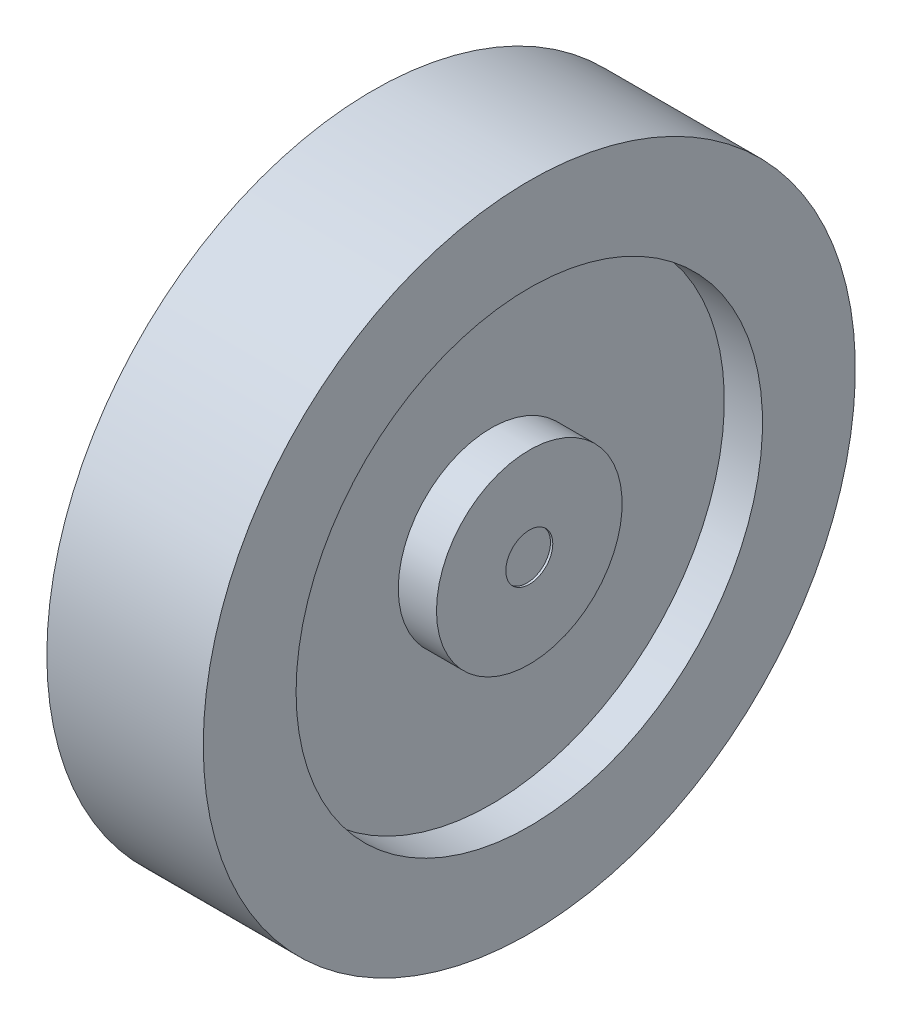
ISO-10303-21;
HEADER;
FILE_DESCRIPTION(('STEP AP214'),'2;1');
FILE_NAME('part.step','',(''),(''),'','','');
FILE_SCHEMA(('AUTOMOTIVE_DESIGN { 1 0 10303 214 1 1 1 1 }'));
ENDSEC;
DATA;
#1=APPLICATION_CONTEXT('core data for automotive mechanical design processes');
#2=APPLICATION_PROTOCOL_DEFINITION('international standard','automotive_design',2000,#1);
#3=PRODUCT_CONTEXT('',#1,'mechanical');
#4=PRODUCT('Part','Part','',(#3));
#5=PRODUCT_RELATED_PRODUCT_CATEGORY('part','',(#4));
#6=PRODUCT_DEFINITION_FORMATION('','',#4);
#7=PRODUCT_DEFINITION_CONTEXT('part definition',#1,'design');
#8=PRODUCT_DEFINITION('design','',#6,#7);
#9=PRODUCT_DEFINITION_SHAPE('','',#8);
#10=(LENGTH_UNIT() NAMED_UNIT(*) SI_UNIT(.MILLI.,.METRE.));
#11=(NAMED_UNIT(*) PLANE_ANGLE_UNIT() SI_UNIT($,.RADIAN.));
#12=(NAMED_UNIT(*) SI_UNIT($,.STERADIAN.) SOLID_ANGLE_UNIT());
#13=UNCERTAINTY_MEASURE_WITH_UNIT(LENGTH_MEASURE(1.E-05),#10,'distance_accuracy_value','');
#14=(GEOMETRIC_REPRESENTATION_CONTEXT(3) GLOBAL_UNCERTAINTY_ASSIGNED_CONTEXT((#13)) GLOBAL_UNIT_ASSIGNED_CONTEXT((#10,
#11,#12)) REPRESENTATION_CONTEXT('',''));
#15=CARTESIAN_POINT('',(0.,0.,0.));
#16=DIRECTION('',(0.,0.,1.));
#17=DIRECTION('',(1.,0.,0.));
#18=AXIS2_PLACEMENT_3D('',#15,#16,#17);
#19=CARTESIAN_POINT('',(-8.30608672469376,10.16,0.));
#20=DIRECTION('',(-1.,0.,0.));
#21=DIRECTION('',(0.,0.,1.));
#22=AXIS2_PLACEMENT_3D('',#19,#20,#21);
#23=PLANE('',#22);
#24=CARTESIAN_POINT('',(-8.30608672469376,0.,0.));
#25=DIRECTION('',(-1.,0.,0.));
#26=DIRECTION('',(0.,0.,1.));
#27=AXIS2_PLACEMENT_3D('',#24,#25,#26);
#28=CIRCLE('',#27,2.57112981588725);
#29=CARTESIAN_POINT('',(-8.30608672469376,0.,2.57112981588725));
#30=VERTEX_POINT('',#29);
#31=EDGE_CURVE('E103',#30,#30,#28,.T.);
#32=ORIENTED_EDGE('',*,*,#31,.T.);
#33=EDGE_LOOP('',(#32));
#34=FACE_BOUND('',#33,.T.);
#35=CARTESIAN_POINT('',(-8.30608672469377,0.,0.));
#36=DIRECTION('',(-1.,0.,0.));
#37=DIRECTION('',(0.,0.,1.));
#38=AXIS2_PLACEMENT_3D('',#35,#36,#37);
#39=CIRCLE('',#38,9.906);
#40=CARTESIAN_POINT('',(-8.30608672469377,0.,9.906));
#41=VERTEX_POINT('',#40);
#42=EDGE_CURVE('E70',#41,#41,#39,.T.);
#43=ORIENTED_EDGE('',*,*,#42,.F.);
#44=EDGE_LOOP('',(#43));
#45=FACE_BOUND('',#44,.T.);
#46=ADVANCED_FACE('F32',(#34,#45),#23,.F.);
#47=CARTESIAN_POINT('',(-8.56008672469376,0.,0.));
#48=DIRECTION('',(-1.,0.,0.));
#49=DIRECTION('',(0.,0.,1.));
#50=AXIS2_PLACEMENT_3D('',#47,#48,#49);
#51=CYLINDRICAL_SURFACE('',#50,9.906);
#52=CARTESIAN_POINT('',(-4.12557925449448,0.,0.));
#53=DIRECTION('',(-1.,0.,0.));
#54=DIRECTION('',(0.,0.,1.));
#55=AXIS2_PLACEMENT_3D('',#52,#53,#54);
#56=CIRCLE('',#55,9.906);
#57=CARTESIAN_POINT('',(-4.12557925449448,0.,9.906));
#58=VERTEX_POINT('',#57);
#59=EDGE_CURVE('E73',#58,#58,#56,.T.);
#60=ORIENTED_EDGE('',*,*,#59,.F.);
#61=EDGE_LOOP('',(#60));
#62=FACE_BOUND('',#61,.T.);
#63=ORIENTED_EDGE('',*,*,#42,.T.);
#64=EDGE_LOOP('',(#63));
#65=FACE_BOUND('',#64,.T.);
#66=ADVANCED_FACE('F128',(#62,#65),#51,.F.);
#67=CARTESIAN_POINT('',(-4.12557925449448,25.527,0.));
#68=DIRECTION('',(-1.,0.,0.));
#69=DIRECTION('',(0.,0.,1.));
#70=AXIS2_PLACEMENT_3D('',#67,#68,#69);
#71=PLANE('',#70);
#72=CARTESIAN_POINT('',(-4.12557925449448,0.,0.));
#73=DIRECTION('',(-1.,0.,0.));
#74=DIRECTION('',(0.,0.,1.));
#75=AXIS2_PLACEMENT_3D('',#72,#73,#74);
#76=CIRCLE('',#75,25.781);
#77=CARTESIAN_POINT('',(-4.12557925449448,0.,25.781));
#78=VERTEX_POINT('',#77);
#79=EDGE_CURVE('E76',#78,#78,#76,.T.);
#80=ORIENTED_EDGE('',*,*,#79,.F.);
#81=EDGE_LOOP('',(#80));
#82=FACE_BOUND('',#81,.T.);
#83=ORIENTED_EDGE('',*,*,#59,.T.);
#84=EDGE_LOOP('',(#83));
#85=FACE_BOUND('',#84,.T.);
#86=ADVANCED_FACE('F134',(#82,#85),#71,.F.);
#87=CARTESIAN_POINT('',(-8.56008672469376,0.,0.));
#88=DIRECTION('',(-1.,0.,0.));
#89=DIRECTION('',(0.,0.,1.));
#90=AXIS2_PLACEMENT_3D('',#87,#88,#89);
#91=CYLINDRICAL_SURFACE('',#90,25.781);
#92=CARTESIAN_POINT('',(-8.30608672469376,0.,0.));
#93=DIRECTION('',(-1.,0.,0.));
#94=DIRECTION('',(0.,0.,1.));
#95=AXIS2_PLACEMENT_3D('',#92,#93,#94);
#96=CIRCLE('',#95,25.781);
#97=CARTESIAN_POINT('',(-8.30608672469376,0.,25.781));
#98=VERTEX_POINT('',#97);
#99=EDGE_CURVE('E79',#98,#98,#96,.T.);
#100=ORIENTED_EDGE('',*,*,#99,.F.);
#101=EDGE_LOOP('',(#100));
#102=FACE_BOUND('',#101,.T.);
#103=ORIENTED_EDGE('',*,*,#79,.T.);
#104=EDGE_LOOP('',(#103));
#105=FACE_BOUND('',#104,.T.);
#106=ADVANCED_FACE('F284',(#102,#105),#91,.T.);
#107=CARTESIAN_POINT('',(-8.30608672469376,35.687,0.));
#108=DIRECTION('',(-1.,0.,0.));
#109=DIRECTION('',(0.,0.,1.));
#110=AXIS2_PLACEMENT_3D('',#107,#108,#109);
#111=PLANE('',#110);
#112=CARTESIAN_POINT('',(-8.30608672469376,0.,0.));
#113=DIRECTION('',(-1.,0.,0.));
#114=DIRECTION('',(0.,0.,1.));
#115=AXIS2_PLACEMENT_3D('',#112,#113,#114);
#116=CIRCLE('',#115,35.433);
#117=CARTESIAN_POINT('',(-8.30608672469376,0.,35.433));
#118=VERTEX_POINT('',#117);
#119=EDGE_CURVE('E82',#118,#118,#116,.T.);
#120=ORIENTED_EDGE('',*,*,#119,.F.);
#121=EDGE_LOOP('',(#120));
#122=FACE_BOUND('',#121,.T.);
#123=ORIENTED_EDGE('',*,*,#99,.T.);
#124=EDGE_LOOP('',(#123));
#125=FACE_BOUND('',#124,.T.);
#126=ADVANCED_FACE('F274',(#122,#125),#111,.F.);
#127=CARTESIAN_POINT('',(-8.56008672469376,0.,0.));
#128=DIRECTION('',(-1.,0.,0.));
#129=DIRECTION('',(0.,0.,1.));
#130=AXIS2_PLACEMENT_3D('',#127,#128,#129);
#131=CYLINDRICAL_SURFACE('',#130,35.433);
#132=CARTESIAN_POINT('',(8.30608672469376,0.,0.));
#133=DIRECTION('',(-1.,0.,0.));
#134=DIRECTION('',(0.,0.,1.));
#135=AXIS2_PLACEMENT_3D('',#132,#133,#134);
#136=CIRCLE('',#135,35.433);
#137=CARTESIAN_POINT('',(8.30608672469376,0.,35.433));
#138=VERTEX_POINT('',#137);
#139=EDGE_CURVE('E85',#138,#138,#136,.T.);
#140=ORIENTED_EDGE('',*,*,#139,.F.);
#141=EDGE_LOOP('',(#140));
#142=FACE_BOUND('',#141,.T.);
#143=ORIENTED_EDGE('',*,*,#119,.T.);
#144=EDGE_LOOP('',(#143));
#145=FACE_BOUND('',#144,.T.);
#146=ADVANCED_FACE('F264',(#142,#145),#131,.F.);
#147=CARTESIAN_POINT('',(8.30608672469376,35.687,0.));
#148=DIRECTION('',(1.,0.,0.));
#149=DIRECTION('',(0.,0.,-1.));
#150=AXIS2_PLACEMENT_3D('',#147,#148,#149);
#151=PLANE('',#150);
#152=CARTESIAN_POINT('',(8.30608672469376,0.,0.));
#153=DIRECTION('',(-1.,0.,0.));
#154=DIRECTION('',(0.,0.,1.));
#155=AXIS2_PLACEMENT_3D('',#152,#153,#154);
#156=CIRCLE('',#155,25.781);
#157=CARTESIAN_POINT('',(8.30608672469376,0.,25.781));
#158=VERTEX_POINT('',#157);
#159=EDGE_CURVE('E88',#158,#158,#156,.T.);
#160=ORIENTED_EDGE('',*,*,#159,.F.);
#161=EDGE_LOOP('',(#160));
#162=FACE_BOUND('',#161,.T.);
#163=ORIENTED_EDGE('',*,*,#139,.T.);
#164=EDGE_LOOP('',(#163));
#165=FACE_BOUND('',#164,.T.);
#166=ADVANCED_FACE('F254',(#162,#165),#151,.F.);
#167=CARTESIAN_POINT('',(-8.56008672469376,0.,0.));
#168=DIRECTION('',(-1.,0.,0.));
#169=DIRECTION('',(0.,0.,1.));
#170=AXIS2_PLACEMENT_3D('',#167,#168,#169);
#171=CYLINDRICAL_SURFACE('',#170,25.781);
#172=CARTESIAN_POINT('',(4.12557925449449,0.,0.));
#173=DIRECTION('',(-1.,0.,0.));
#174=DIRECTION('',(0.,0.,1.));
#175=AXIS2_PLACEMENT_3D('',#172,#173,#174);
#176=CIRCLE('',#175,25.781);
#177=CARTESIAN_POINT('',(4.12557925449449,0.,25.781));
#178=VERTEX_POINT('',#177);
#179=EDGE_CURVE('E91',#178,#178,#176,.T.);
#180=ORIENTED_EDGE('',*,*,#179,.F.);
#181=EDGE_LOOP('',(#180));
#182=FACE_BOUND('',#181,.T.);
#183=ORIENTED_EDGE('',*,*,#159,.T.);
#184=EDGE_LOOP('',(#183));
#185=FACE_BOUND('',#184,.T.);
#186=ADVANCED_FACE('F244',(#182,#185),#171,.T.);
#187=CARTESIAN_POINT('',(4.12557925449448,25.527,0.));
#188=DIRECTION('',(1.,0.,0.));
#189=DIRECTION('',(0.,0.,-1.));
#190=AXIS2_PLACEMENT_3D('',#187,#188,#189);
#191=PLANE('',#190);
#192=CARTESIAN_POINT('',(4.12557925449449,0.,0.));
#193=DIRECTION('',(-1.,0.,0.));
#194=DIRECTION('',(0.,0.,1.));
#195=AXIS2_PLACEMENT_3D('',#192,#193,#194);
#196=CIRCLE('',#195,9.906);
#197=CARTESIAN_POINT('',(4.12557925449449,0.,9.906));
#198=VERTEX_POINT('',#197);
#199=EDGE_CURVE('E94',#198,#198,#196,.T.);
#200=ORIENTED_EDGE('',*,*,#199,.F.);
#201=EDGE_LOOP('',(#200));
#202=FACE_BOUND('',#201,.T.);
#203=ORIENTED_EDGE('',*,*,#179,.T.);
#204=EDGE_LOOP('',(#203));
#205=FACE_BOUND('',#204,.T.);
#206=ADVANCED_FACE('F234',(#202,#205),#191,.F.);
#207=CARTESIAN_POINT('',(-8.56008672469376,0.,0.));
#208=DIRECTION('',(-1.,0.,0.));
#209=DIRECTION('',(0.,0.,1.));
#210=AXIS2_PLACEMENT_3D('',#207,#208,#209);
#211=CYLINDRICAL_SURFACE('',#210,9.906);
#212=CARTESIAN_POINT('',(8.30608672469377,0.,0.));
#213=DIRECTION('',(-1.,0.,0.));
#214=DIRECTION('',(0.,0.,1.));
#215=AXIS2_PLACEMENT_3D('',#212,#213,#214);
#216=CIRCLE('',#215,9.906);
#217=CARTESIAN_POINT('',(8.30608672469377,0.,9.906));
#218=VERTEX_POINT('',#217);
#219=EDGE_CURVE('E97',#218,#218,#216,.T.);
#220=ORIENTED_EDGE('',*,*,#219,.F.);
#221=EDGE_LOOP('',(#220));
#222=FACE_BOUND('',#221,.T.);
#223=ORIENTED_EDGE('',*,*,#199,.T.);
#224=EDGE_LOOP('',(#223));
#225=FACE_BOUND('',#224,.T.);
#226=ADVANCED_FACE('F125',(#222,#225),#211,.F.);
#227=CARTESIAN_POINT('',(8.30608672469376,10.16,0.));
#228=DIRECTION('',(1.,0.,0.));
#229=DIRECTION('',(0.,0.,-1.));
#230=AXIS2_PLACEMENT_3D('',#227,#228,#229);
#231=PLANE('',#230);
#232=CARTESIAN_POINT('',(8.30608672469376,0.,0.));
#233=DIRECTION('',(1.,0.,0.));
#234=DIRECTION('',(0.,0.,-1.));
#235=AXIS2_PLACEMENT_3D('',#232,#233,#234);
#236=CIRCLE('',#235,2.57112981588725);
#237=CARTESIAN_POINT('',(8.30608672469376,0.,-2.57112981588725));
#238=VERTEX_POINT('',#237);
#239=EDGE_CURVE('E36',#238,#238,#236,.T.);
#240=ORIENTED_EDGE('',*,*,#239,.T.);
#241=EDGE_LOOP('',(#240));
#242=FACE_BOUND('',#241,.T.);
#243=ORIENTED_EDGE('',*,*,#219,.T.);
#244=EDGE_LOOP('',(#243));
#245=FACE_BOUND('',#244,.T.);
#246=ADVANCED_FACE('F113',(#242,#245),#231,.F.);
#247=CARTESIAN_POINT('',(16.8399132753062,0.,0.));
#248=DIRECTION('',(-1.,0.,0.));
#249=DIRECTION('',(0.,0.,1.));
#250=AXIS2_PLACEMENT_3D('',#247,#248,#249);
#251=CYLINDRICAL_SURFACE('',#250,2.57112981588725);
#252=CARTESIAN_POINT('',(8.56008672469376,0.,0.));
#253=DIRECTION('',(1.,0.,0.));
#254=DIRECTION('',(0.,0.,-1.));
#255=AXIS2_PLACEMENT_3D('',#252,#253,#254);
#256=CIRCLE('',#255,2.57112981588725);
#257=CARTESIAN_POINT('',(8.56008672469376,0.,-2.57112981588725));
#258=VERTEX_POINT('',#257);
#259=EDGE_CURVE('E100',#258,#258,#256,.T.);
#260=ORIENTED_EDGE('',*,*,#259,.T.);
#261=EDGE_LOOP('',(#260));
#262=FACE_BOUND('',#261,.T.);
#263=ORIENTED_EDGE('',*,*,#239,.F.);
#264=EDGE_LOOP('',(#263));
#265=FACE_BOUND('',#264,.T.);
#266=ADVANCED_FACE('F116',(#262,#265),#251,.F.);
#267=CARTESIAN_POINT('',(-8.56008672469376,0.,0.));
#268=DIRECTION('',(-1.,0.,0.));
#269=DIRECTION('',(0.,0.,1.));
#270=AXIS2_PLACEMENT_3D('',#267,#268,#269);
#271=CIRCLE('',#270,2.57112981588725);
#272=CARTESIAN_POINT('',(-8.56008672469376,0.,2.57112981588725));
#273=VERTEX_POINT('',#272);
#274=EDGE_CURVE('E106',#273,#273,#271,.T.);
#275=ORIENTED_EDGE('',*,*,#274,.T.);
#276=EDGE_LOOP('',(#275));
#277=FACE_BOUND('',#276,.T.);
#278=ORIENTED_EDGE('',*,*,#31,.F.);
#279=EDGE_LOOP('',(#278));
#280=FACE_BOUND('',#279,.T.);
#281=ADVANCED_FACE('F118',(#277,#280),#251,.F.);
#282=CARTESIAN_POINT('',(8.56008672469376,10.16,0.));
#283=DIRECTION('',(1.,0.,0.));
#284=DIRECTION('',(0.,0.,-1.));
#285=AXIS2_PLACEMENT_3D('',#282,#283,#284);
#286=PLANE('',#285);
#287=ORIENTED_EDGE('',*,*,#259,.F.);
#288=EDGE_LOOP('',(#287));
#289=FACE_BOUND('',#288,.T.);
#290=CARTESIAN_POINT('',(8.56008672469376,0.,0.));
#291=DIRECTION('',(-1.,0.,0.));
#292=DIRECTION('',(0.,0.,1.));
#293=AXIS2_PLACEMENT_3D('',#290,#291,#292);
#294=CIRCLE('',#293,10.16);
#295=CARTESIAN_POINT('',(8.56008672469376,0.,10.16));
#296=VERTEX_POINT('',#295);
#297=EDGE_CURVE('E10',#296,#296,#294,.T.);
#298=ORIENTED_EDGE('',*,*,#297,.F.);
#299=EDGE_LOOP('',(#298));
#300=FACE_BOUND('',#299,.T.);
#301=ADVANCED_FACE('F34',(#289,#300),#286,.T.);
#302=CARTESIAN_POINT('',(-8.56008672469376,0.,0.));
#303=DIRECTION('',(-1.,0.,0.));
#304=DIRECTION('',(0.,0.,1.));
#305=AXIS2_PLACEMENT_3D('',#302,#303,#304);
#306=CYLINDRICAL_SURFACE('',#305,10.16);
#307=ORIENTED_EDGE('',*,*,#297,.T.);
#308=EDGE_LOOP('',(#307));
#309=FACE_BOUND('',#308,.T.);
#310=CARTESIAN_POINT('',(4.37957925449448,0.,0.));
#311=DIRECTION('',(-1.,0.,0.));
#312=DIRECTION('',(0.,0.,1.));
#313=AXIS2_PLACEMENT_3D('',#310,#311,#312);
#314=CIRCLE('',#313,10.16);
#315=CARTESIAN_POINT('',(4.37957925449448,0.,10.16));
#316=VERTEX_POINT('',#315);
#317=EDGE_CURVE('E40',#316,#316,#314,.T.);
#318=ORIENTED_EDGE('',*,*,#317,.F.);
#319=EDGE_LOOP('',(#318));
#320=FACE_BOUND('',#319,.T.);
#321=ADVANCED_FACE('F174',(#309,#320),#306,.T.);
#322=CARTESIAN_POINT('',(4.37957925449448,25.527,0.));
#323=DIRECTION('',(1.,0.,0.));
#324=DIRECTION('',(0.,0.,-1.));
#325=AXIS2_PLACEMENT_3D('',#322,#323,#324);
#326=PLANE('',#325);
#327=ORIENTED_EDGE('',*,*,#317,.T.);
#328=EDGE_LOOP('',(#327));
#329=FACE_BOUND('',#328,.T.);
#330=CARTESIAN_POINT('',(4.37957925449448,0.,0.));
#331=DIRECTION('',(-1.,0.,0.));
#332=DIRECTION('',(0.,0.,1.));
#333=AXIS2_PLACEMENT_3D('',#330,#331,#332);
#334=CIRCLE('',#333,25.527);
#335=CARTESIAN_POINT('',(4.37957925449448,0.,25.527));
#336=VERTEX_POINT('',#335);
#337=EDGE_CURVE('E44',#336,#336,#334,.T.);
#338=ORIENTED_EDGE('',*,*,#337,.F.);
#339=EDGE_LOOP('',(#338));
#340=FACE_BOUND('',#339,.T.);
#341=ADVANCED_FACE('F171',(#329,#340),#326,.T.);
#342=CARTESIAN_POINT('',(-8.56008672469376,0.,0.));
#343=DIRECTION('',(-1.,0.,0.));
#344=DIRECTION('',(0.,0.,1.));
#345=AXIS2_PLACEMENT_3D('',#342,#343,#344);
#346=CYLINDRICAL_SURFACE('',#345,25.527);
#347=ORIENTED_EDGE('',*,*,#337,.T.);
#348=EDGE_LOOP('',(#347));
#349=FACE_BOUND('',#348,.T.);
#350=CARTESIAN_POINT('',(8.56008672469376,0.,0.));
#351=DIRECTION('',(-1.,0.,0.));
#352=DIRECTION('',(0.,0.,1.));
#353=AXIS2_PLACEMENT_3D('',#350,#351,#352);
#354=CIRCLE('',#353,25.527);
#355=CARTESIAN_POINT('',(8.56008672469376,0.,25.527));
#356=VERTEX_POINT('',#355);
#357=EDGE_CURVE('E49',#356,#356,#354,.T.);
#358=ORIENTED_EDGE('',*,*,#357,.F.);
#359=EDGE_LOOP('',(#358));
#360=FACE_BOUND('',#359,.T.);
#361=ADVANCED_FACE('F167',(#349,#360),#346,.F.);
#362=CARTESIAN_POINT('',(8.56008672469376,35.687,0.));
#363=DIRECTION('',(1.,0.,0.));
#364=DIRECTION('',(0.,0.,-1.));
#365=AXIS2_PLACEMENT_3D('',#362,#363,#364);
#366=PLANE('',#365);
#367=ORIENTED_EDGE('',*,*,#357,.T.);
#368=EDGE_LOOP('',(#367));
#369=FACE_BOUND('',#368,.T.);
#370=CARTESIAN_POINT('',(8.56008672469376,0.,0.));
#371=DIRECTION('',(-1.,0.,0.));
#372=DIRECTION('',(0.,0.,1.));
#373=AXIS2_PLACEMENT_3D('',#370,#371,#372);
#374=CIRCLE('',#373,35.687);
#375=CARTESIAN_POINT('',(8.56008672469376,0.,35.687));
#376=VERTEX_POINT('',#375);
#377=EDGE_CURVE('E52',#376,#376,#374,.T.);
#378=ORIENTED_EDGE('',*,*,#377,.F.);
#379=EDGE_LOOP('',(#378));
#380=FACE_BOUND('',#379,.T.);
#381=ADVANCED_FACE('F163',(#369,#380),#366,.T.);
#382=CARTESIAN_POINT('',(-8.56008672469376,0.,0.));
#383=DIRECTION('',(-1.,0.,0.));
#384=DIRECTION('',(0.,0.,1.));
#385=AXIS2_PLACEMENT_3D('',#382,#383,#384);
#386=CYLINDRICAL_SURFACE('',#385,35.687);
#387=ORIENTED_EDGE('',*,*,#377,.T.);
#388=EDGE_LOOP('',(#387));
#389=FACE_BOUND('',#388,.T.);
#390=CARTESIAN_POINT('',(-8.56008672469376,0.,0.));
#391=DIRECTION('',(-1.,0.,0.));
#392=DIRECTION('',(0.,0.,1.));
#393=AXIS2_PLACEMENT_3D('',#390,#391,#392);
#394=CIRCLE('',#393,35.687);
#395=CARTESIAN_POINT('',(-8.56008672469376,0.,35.687));
#396=VERTEX_POINT('',#395);
#397=EDGE_CURVE('E55',#396,#396,#394,.T.);
#398=ORIENTED_EDGE('',*,*,#397,.F.);
#399=EDGE_LOOP('',(#398));
#400=FACE_BOUND('',#399,.T.);
#401=ADVANCED_FACE('F159',(#389,#400),#386,.T.);
#402=CARTESIAN_POINT('',(-8.56008672469376,35.687,0.));
#403=DIRECTION('',(-1.,0.,0.));
#404=DIRECTION('',(0.,0.,1.));
#405=AXIS2_PLACEMENT_3D('',#402,#403,#404);
#406=PLANE('',#405);
#407=ORIENTED_EDGE('',*,*,#397,.T.);
#408=EDGE_LOOP('',(#407));
#409=FACE_BOUND('',#408,.T.);
#410=CARTESIAN_POINT('',(-8.56008672469376,0.,0.));
#411=DIRECTION('',(-1.,0.,0.));
#412=DIRECTION('',(0.,0.,1.));
#413=AXIS2_PLACEMENT_3D('',#410,#411,#412);
#414=CIRCLE('',#413,25.527);
#415=CARTESIAN_POINT('',(-8.56008672469376,0.,25.527));
#416=VERTEX_POINT('',#415);
#417=EDGE_CURVE('E58',#416,#416,#414,.T.);
#418=ORIENTED_EDGE('',*,*,#417,.F.);
#419=EDGE_LOOP('',(#418));
#420=FACE_BOUND('',#419,.T.);
#421=ADVANCED_FACE('F155',(#409,#420),#406,.T.);
#422=CARTESIAN_POINT('',(-8.56008672469376,0.,0.));
#423=DIRECTION('',(-1.,0.,0.));
#424=DIRECTION('',(0.,0.,1.));
#425=AXIS2_PLACEMENT_3D('',#422,#423,#424);
#426=CYLINDRICAL_SURFACE('',#425,25.527);
#427=ORIENTED_EDGE('',*,*,#417,.T.);
#428=EDGE_LOOP('',(#427));
#429=FACE_BOUND('',#428,.T.);
#430=CARTESIAN_POINT('',(-4.37957925449448,0.,0.));
#431=DIRECTION('',(-1.,0.,0.));
#432=DIRECTION('',(0.,0.,1.));
#433=AXIS2_PLACEMENT_3D('',#430,#431,#432);
#434=CIRCLE('',#433,25.527);
#435=CARTESIAN_POINT('',(-4.37957925449448,0.,25.527));
#436=VERTEX_POINT('',#435);
#437=EDGE_CURVE('E61',#436,#436,#434,.T.);
#438=ORIENTED_EDGE('',*,*,#437,.F.);
#439=EDGE_LOOP('',(#438));
#440=FACE_BOUND('',#439,.T.);
#441=ADVANCED_FACE('F151',(#429,#440),#426,.F.);
#442=CARTESIAN_POINT('',(-4.37957925449448,25.527,0.));
#443=DIRECTION('',(-1.,0.,0.));
#444=DIRECTION('',(0.,0.,1.));
#445=AXIS2_PLACEMENT_3D('',#442,#443,#444);
#446=PLANE('',#445);
#447=ORIENTED_EDGE('',*,*,#437,.T.);
#448=EDGE_LOOP('',(#447));
#449=FACE_BOUND('',#448,.T.);
#450=CARTESIAN_POINT('',(-4.37957925449448,0.,0.));
#451=DIRECTION('',(-1.,0.,0.));
#452=DIRECTION('',(0.,0.,1.));
#453=AXIS2_PLACEMENT_3D('',#450,#451,#452);
#454=CIRCLE('',#453,10.16);
#455=CARTESIAN_POINT('',(-4.37957925449448,0.,10.16));
#456=VERTEX_POINT('',#455);
#457=EDGE_CURVE('E64',#456,#456,#454,.T.);
#458=ORIENTED_EDGE('',*,*,#457,.F.);
#459=EDGE_LOOP('',(#458));
#460=FACE_BOUND('',#459,.T.);
#461=ADVANCED_FACE('F147',(#449,#460),#446,.T.);
#462=CARTESIAN_POINT('',(-8.56008672469376,0.,0.));
#463=DIRECTION('',(-1.,0.,0.));
#464=DIRECTION('',(0.,0.,1.));
#465=AXIS2_PLACEMENT_3D('',#462,#463,#464);
#466=CYLINDRICAL_SURFACE('',#465,10.16);
#467=ORIENTED_EDGE('',*,*,#457,.T.);
#468=EDGE_LOOP('',(#467));
#469=FACE_BOUND('',#468,.T.);
#470=CARTESIAN_POINT('',(-8.56008672469377,0.,0.));
#471=DIRECTION('',(-1.,0.,0.));
#472=DIRECTION('',(0.,0.,1.));
#473=AXIS2_PLACEMENT_3D('',#470,#471,#472);
#474=CIRCLE('',#473,10.16);
#475=CARTESIAN_POINT('',(-8.56008672469377,0.,10.16));
#476=VERTEX_POINT('',#475);
#477=EDGE_CURVE('E67',#476,#476,#474,.T.);
#478=ORIENTED_EDGE('',*,*,#477,.F.);
#479=EDGE_LOOP('',(#478));
#480=FACE_BOUND('',#479,.T.);
#481=ADVANCED_FACE('F143',(#469,#480),#466,.T.);
#482=CARTESIAN_POINT('',(-8.56008672469376,10.16,0.));
#483=DIRECTION('',(-1.,0.,0.));
#484=DIRECTION('',(0.,0.,1.));
#485=AXIS2_PLACEMENT_3D('',#482,#483,#484);
#486=PLANE('',#485);
#487=ORIENTED_EDGE('',*,*,#274,.F.);
#488=EDGE_LOOP('',(#487));
#489=FACE_BOUND('',#488,.T.);
#490=ORIENTED_EDGE('',*,*,#477,.T.);
#491=EDGE_LOOP('',(#490));
#492=FACE_BOUND('',#491,.T.);
#493=ADVANCED_FACE('F140',(#489,#492),#486,.T.);
#494=CLOSED_SHELL('',(#46,#66,#86,#106,#126,#146,#166,#186,#206,#226,#246,#266,#281,#301,#321,
#341,#361,#381,#401,#421,#441,#461,#481,#493));
#495=MANIFOLD_SOLID_BREP('B2',#494);
#496=ADVANCED_BREP_SHAPE_REPRESENTATION('',(#18,#495),#14);
#497=SHAPE_DEFINITION_REPRESENTATION(#9,#496);
ENDSEC;
END-ISO-10303-21;
